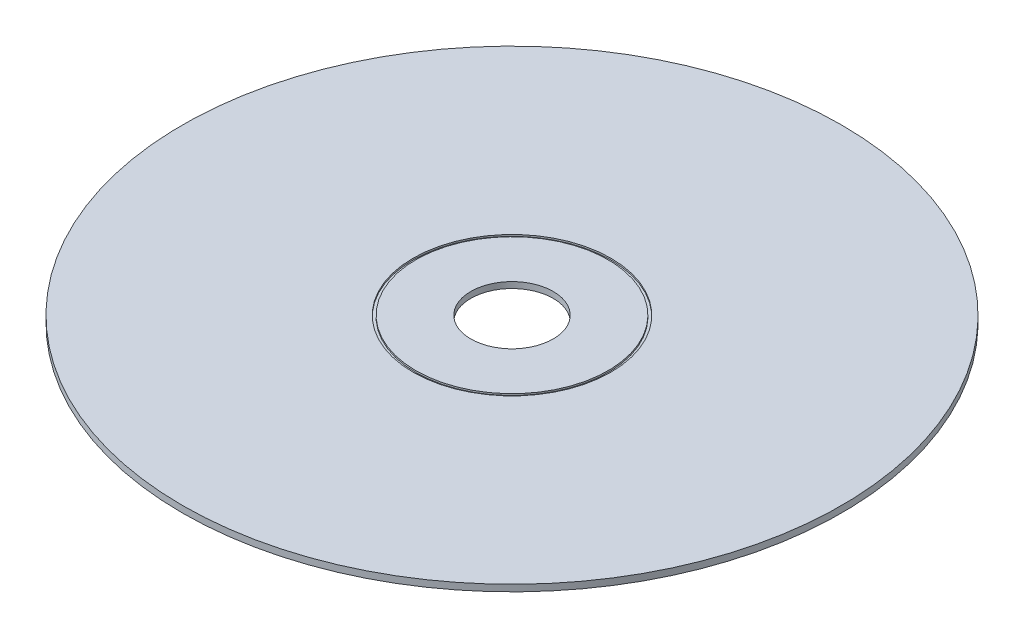
ISO-10303-21;
HEADER;
FILE_DESCRIPTION(('STEP AP214'),'2;1');
FILE_NAME('part.step','',(''),(''),'','','');
FILE_SCHEMA(('AUTOMOTIVE_DESIGN { 1 0 10303 214 1 1 1 1 }'));
ENDSEC;
DATA;
#1=APPLICATION_CONTEXT('core data for automotive mechanical design processes');
#2=APPLICATION_PROTOCOL_DEFINITION('international standard','automotive_design',2000,#1);
#3=PRODUCT_CONTEXT('',#1,'mechanical');
#4=PRODUCT('Part','Part','',(#3));
#5=PRODUCT_RELATED_PRODUCT_CATEGORY('part','',(#4));
#6=PRODUCT_DEFINITION_FORMATION('','',#4);
#7=PRODUCT_DEFINITION_CONTEXT('part definition',#1,'design');
#8=PRODUCT_DEFINITION('design','',#6,#7);
#9=PRODUCT_DEFINITION_SHAPE('','',#8);
#10=(LENGTH_UNIT() NAMED_UNIT(*) SI_UNIT(.MILLI.,.METRE.));
#11=(NAMED_UNIT(*) PLANE_ANGLE_UNIT() SI_UNIT($,.RADIAN.));
#12=(NAMED_UNIT(*) SI_UNIT($,.STERADIAN.) SOLID_ANGLE_UNIT());
#13=UNCERTAINTY_MEASURE_WITH_UNIT(LENGTH_MEASURE(1.E-05),#10,'distance_accuracy_value','');
#14=(GEOMETRIC_REPRESENTATION_CONTEXT(3) GLOBAL_UNCERTAINTY_ASSIGNED_CONTEXT((#13)) GLOBAL_UNIT_ASSIGNED_CONTEXT((#10,
#11,#12)) REPRESENTATION_CONTEXT('',''));
#15=CARTESIAN_POINT('',(0.,0.,0.));
#16=DIRECTION('',(0.,0.,1.));
#17=DIRECTION('',(1.,0.,0.));
#18=AXIS2_PLACEMENT_3D('',#15,#16,#17);
#19=CARTESIAN_POINT('',(0.,1.2,0.));
#20=DIRECTION('',(0.,-1.,0.));
#21=DIRECTION('',(0.,0.,-1.));
#22=AXIS2_PLACEMENT_3D('',#19,#20,#21);
#23=CYLINDRICAL_SURFACE('',#22,7.5);
#24=CARTESIAN_POINT('',(0.,1.2,0.));
#25=DIRECTION('',(0.,1.,0.));
#26=DIRECTION('',(0.,0.,1.));
#27=AXIS2_PLACEMENT_3D('',#24,#25,#26);
#28=CIRCLE('',#27,7.5);
#29=CARTESIAN_POINT('',(0.,1.2,7.5));
#30=VERTEX_POINT('',#29);
#31=EDGE_CURVE('E44',#30,#30,#28,.T.);
#32=ORIENTED_EDGE('',*,*,#31,.T.);
#33=EDGE_LOOP('',(#32));
#34=FACE_BOUND('',#33,.T.);
#35=CARTESIAN_POINT('',(0.,0.1,0.));
#36=DIRECTION('',(0.,-1.,0.));
#37=DIRECTION('',(0.,0.,-1.));
#38=AXIS2_PLACEMENT_3D('',#35,#36,#37);
#39=CIRCLE('',#38,7.5);
#40=CARTESIAN_POINT('',(0.,0.1,-7.5));
#41=VERTEX_POINT('',#40);
#42=EDGE_CURVE('E35',#41,#41,#39,.T.);
#43=ORIENTED_EDGE('',*,*,#42,.T.);
#44=EDGE_LOOP('',(#43));
#45=FACE_BOUND('',#44,.T.);
#46=ADVANCED_FACE('F31',(#34,#45),#23,.F.);
#47=CARTESIAN_POINT('',(0.,1.2,0.));
#48=DIRECTION('',(0.,1.,0.));
#49=DIRECTION('',(0.,0.,1.));
#50=AXIS2_PLACEMENT_3D('',#47,#48,#49);
#51=PLANE('',#50);
#52=ORIENTED_EDGE('',*,*,#31,.F.);
#53=EDGE_LOOP('',(#52));
#54=FACE_BOUND('',#53,.T.);
#55=CARTESIAN_POINT('',(0.,1.2,0.));
#56=DIRECTION('',(0.,1.,0.));
#57=DIRECTION('',(0.,0.,1.));
#58=AXIS2_PLACEMENT_3D('',#55,#56,#57);
#59=CIRCLE('',#58,17.5);
#60=CARTESIAN_POINT('',(0.,1.2,17.5));
#61=VERTEX_POINT('',#60);
#62=EDGE_CURVE('E55',#61,#61,#59,.T.);
#63=ORIENTED_EDGE('',*,*,#62,.T.);
#64=EDGE_LOOP('',(#63));
#65=FACE_BOUND('',#64,.T.);
#66=ADVANCED_FACE('F82',(#54,#65),#51,.T.);
#67=CARTESIAN_POINT('',(0.,1.2,0.));
#68=DIRECTION('',(0.,1.,0.));
#69=DIRECTION('',(0.,0.,1.));
#70=AXIS2_PLACEMENT_3D('',#67,#68,#69);
#71=CIRCLE('',#70,18.);
#72=CARTESIAN_POINT('',(0.,1.2,18.));
#73=VERTEX_POINT('',#72);
#74=EDGE_CURVE('E49',#73,#73,#71,.T.);
#75=ORIENTED_EDGE('',*,*,#74,.F.);
#76=EDGE_LOOP('',(#75));
#77=FACE_BOUND('',#76,.T.);
#78=CARTESIAN_POINT('',(0.,1.2,0.));
#79=DIRECTION('',(0.,1.,0.));
#80=DIRECTION('',(0.,0.,1.));
#81=AXIS2_PLACEMENT_3D('',#78,#79,#80);
#82=CIRCLE('',#81,60.);
#83=CARTESIAN_POINT('',(0.,1.2,60.));
#84=VERTEX_POINT('',#83);
#85=EDGE_CURVE('E10',#84,#84,#82,.T.);
#86=ORIENTED_EDGE('',*,*,#85,.T.);
#87=EDGE_LOOP('',(#86));
#88=FACE_BOUND('',#87,.T.);
#89=ADVANCED_FACE('F88',(#77,#88),#51,.T.);
#90=CARTESIAN_POINT('',(0.,0.,0.));
#91=DIRECTION('',(0.,1.,0.));
#92=DIRECTION('',(0.,0.,1.));
#93=AXIS2_PLACEMENT_3D('',#90,#91,#92);
#94=PLANE('',#93);
#95=CARTESIAN_POINT('',(0.,0.,0.));
#96=DIRECTION('',(0.,-1.,0.));
#97=DIRECTION('',(0.,0.,-1.));
#98=AXIS2_PLACEMENT_3D('',#95,#96,#97);
#99=CIRCLE('',#98,17.5);
#100=CARTESIAN_POINT('',(0.,0.,-17.5));
#101=VERTEX_POINT('',#100);
#102=EDGE_CURVE('E60',#101,#101,#99,.T.);
#103=ORIENTED_EDGE('',*,*,#102,.F.);
#104=EDGE_LOOP('',(#103));
#105=FACE_BOUND('',#104,.T.);
#106=CARTESIAN_POINT('',(0.,0.,0.));
#107=DIRECTION('',(0.,1.,0.));
#108=DIRECTION('',(0.,0.,1.));
#109=AXIS2_PLACEMENT_3D('',#106,#107,#108);
#110=CIRCLE('',#109,60.);
#111=CARTESIAN_POINT('',(0.,0.,60.));
#112=VERTEX_POINT('',#111);
#113=EDGE_CURVE('E39',#112,#112,#110,.T.);
#114=ORIENTED_EDGE('',*,*,#113,.F.);
#115=EDGE_LOOP('',(#114));
#116=FACE_BOUND('',#115,.T.);
#117=ADVANCED_FACE('F95',(#105,#116),#94,.F.);
#118=CARTESIAN_POINT('',(0.,1.2,0.));
#119=DIRECTION('',(0.,-1.,0.));
#120=DIRECTION('',(0.,0.,-1.));
#121=AXIS2_PLACEMENT_3D('',#118,#119,#120);
#122=CYLINDRICAL_SURFACE('',#121,60.);
#123=ORIENTED_EDGE('',*,*,#85,.F.);
#124=EDGE_LOOP('',(#123));
#125=FACE_BOUND('',#124,.T.);
#126=ORIENTED_EDGE('',*,*,#113,.T.);
#127=EDGE_LOOP('',(#126));
#128=FACE_BOUND('',#127,.T.);
#129=ADVANCED_FACE('F33',(#125,#128),#122,.T.);
#130=CARTESIAN_POINT('',(0.,0.9,0.));
#131=DIRECTION('',(0.,1.,0.));
#132=DIRECTION('',(0.,0.,1.));
#133=AXIS2_PLACEMENT_3D('',#130,#131,#132);
#134=CYLINDRICAL_SURFACE('',#133,18.);
#135=CARTESIAN_POINT('',(0.,0.9,0.));
#136=DIRECTION('',(0.,1.,0.));
#137=DIRECTION('',(0.,0.,1.));
#138=AXIS2_PLACEMENT_3D('',#135,#136,#137);
#139=CIRCLE('',#138,18.);
#140=CARTESIAN_POINT('',(0.,0.9,18.));
#141=VERTEX_POINT('',#140);
#142=EDGE_CURVE('E48',#141,#141,#139,.T.);
#143=ORIENTED_EDGE('',*,*,#142,.F.);
#144=EDGE_LOOP('',(#143));
#145=FACE_BOUND('',#144,.T.);
#146=ORIENTED_EDGE('',*,*,#74,.T.);
#147=EDGE_LOOP('',(#146));
#148=FACE_BOUND('',#147,.T.);
#149=ADVANCED_FACE('F92',(#145,#148),#134,.F.);
#150=CARTESIAN_POINT('',(0.,0.9,0.));
#151=DIRECTION('',(0.,1.,0.));
#152=DIRECTION('',(0.,0.,1.));
#153=AXIS2_PLACEMENT_3D('',#150,#151,#152);
#154=PLANE('',#153);
#155=CARTESIAN_POINT('',(0.,0.9,0.));
#156=DIRECTION('',(0.,1.,0.));
#157=DIRECTION('',(0.,0.,1.));
#158=AXIS2_PLACEMENT_3D('',#155,#156,#157);
#159=CIRCLE('',#158,17.5);
#160=CARTESIAN_POINT('',(0.,0.9,17.5));
#161=VERTEX_POINT('',#160);
#162=EDGE_CURVE('E52',#161,#161,#159,.T.);
#163=ORIENTED_EDGE('',*,*,#162,.F.);
#164=EDGE_LOOP('',(#163));
#165=FACE_BOUND('',#164,.T.);
#166=ORIENTED_EDGE('',*,*,#142,.T.);
#167=EDGE_LOOP('',(#166));
#168=FACE_BOUND('',#167,.T.);
#169=ADVANCED_FACE('F111',(#165,#168),#154,.T.);
#170=CARTESIAN_POINT('',(0.,0.9,0.));
#171=DIRECTION('',(0.,1.,0.));
#172=DIRECTION('',(0.,0.,1.));
#173=AXIS2_PLACEMENT_3D('',#170,#171,#172);
#174=CYLINDRICAL_SURFACE('',#173,17.5);
#175=ORIENTED_EDGE('',*,*,#162,.T.);
#176=EDGE_LOOP('',(#175));
#177=FACE_BOUND('',#176,.T.);
#178=ORIENTED_EDGE('',*,*,#62,.F.);
#179=EDGE_LOOP('',(#178));
#180=FACE_BOUND('',#179,.T.);
#181=ADVANCED_FACE('F78',(#177,#180),#174,.T.);
#182=CARTESIAN_POINT('',(0.,0.1,0.));
#183=DIRECTION('',(0.,-1.,0.));
#184=DIRECTION('',(0.,0.,-1.));
#185=AXIS2_PLACEMENT_3D('',#182,#183,#184);
#186=CYLINDRICAL_SURFACE('',#185,17.5);
#187=CARTESIAN_POINT('',(0.,0.1,0.));
#188=DIRECTION('',(0.,-1.,0.));
#189=DIRECTION('',(0.,0.,-1.));
#190=AXIS2_PLACEMENT_3D('',#187,#188,#189);
#191=CIRCLE('',#190,17.5);
#192=CARTESIAN_POINT('',(0.,0.1,-17.5));
#193=VERTEX_POINT('',#192);
#194=EDGE_CURVE('E63',#193,#193,#191,.T.);
#195=ORIENTED_EDGE('',*,*,#194,.F.);
#196=EDGE_LOOP('',(#195));
#197=FACE_BOUND('',#196,.T.);
#198=ORIENTED_EDGE('',*,*,#102,.T.);
#199=EDGE_LOOP('',(#198));
#200=FACE_BOUND('',#199,.T.);
#201=ADVANCED_FACE('F73',(#197,#200),#186,.F.);
#202=CARTESIAN_POINT('',(0.,0.1,0.));
#203=DIRECTION('',(0.,-1.,0.));
#204=DIRECTION('',(0.,0.,-1.));
#205=AXIS2_PLACEMENT_3D('',#202,#203,#204);
#206=PLANE('',#205);
#207=ORIENTED_EDGE('',*,*,#42,.F.);
#208=EDGE_LOOP('',(#207));
#209=FACE_BOUND('',#208,.T.);
#210=ORIENTED_EDGE('',*,*,#194,.T.);
#211=EDGE_LOOP('',(#210));
#212=FACE_BOUND('',#211,.T.);
#213=ADVANCED_FACE('F71',(#209,#212),#206,.T.);
#214=CLOSED_SHELL('',(#46,#66,#89,#117,#129,#149,#169,#181,#201,#213));
#215=MANIFOLD_SOLID_BREP('B2',#214);
#216=ADVANCED_BREP_SHAPE_REPRESENTATION('',(#18,#215),#14);
#217=SHAPE_DEFINITION_REPRESENTATION(#9,#216);
ENDSEC;
END-ISO-10303-21;
